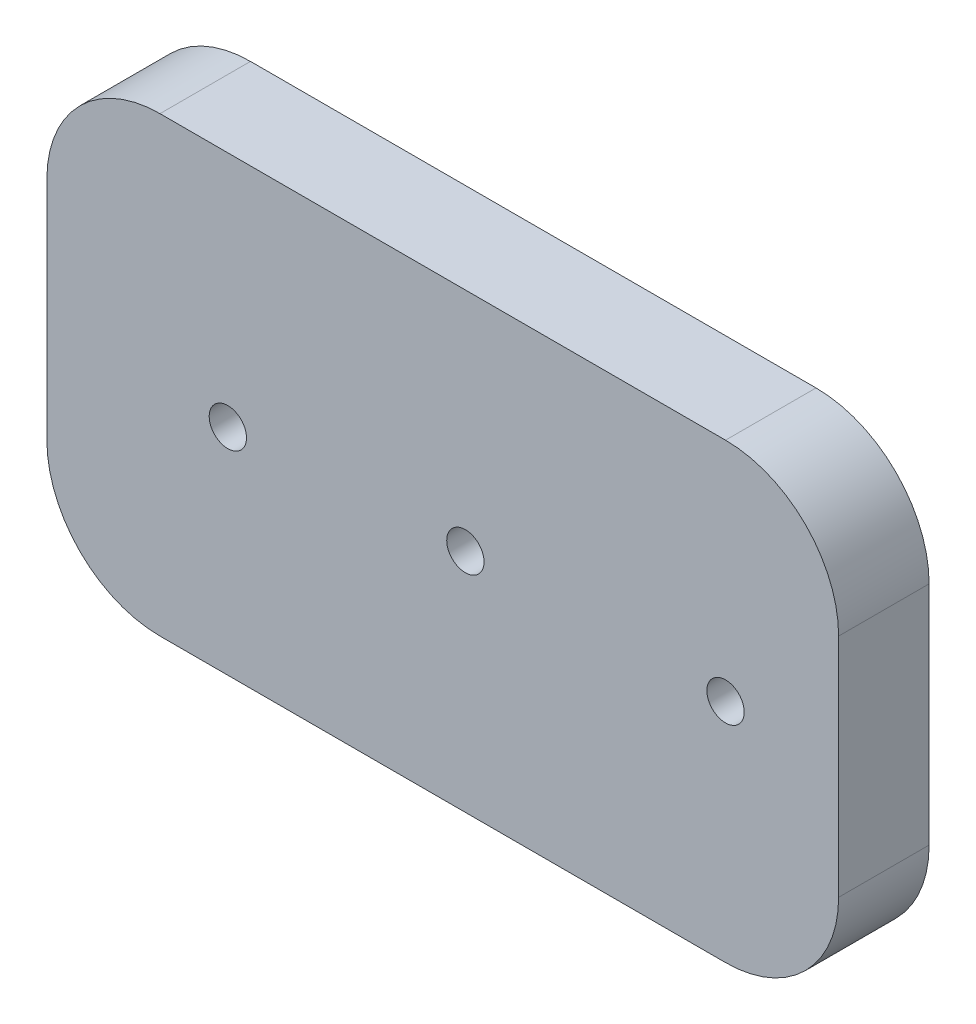
ISO-10303-21;
HEADER;
FILE_DESCRIPTION(('STEP AP214'),'2;1');
FILE_NAME('part.step','',(''),(''),'','','');
FILE_SCHEMA(('AUTOMOTIVE_DESIGN { 1 0 10303 214 1 1 1 1 }'));
ENDSEC;
DATA;
#1=APPLICATION_CONTEXT('core data for automotive mechanical design processes');
#2=APPLICATION_PROTOCOL_DEFINITION('international standard','automotive_design',2000,#1);
#3=PRODUCT_CONTEXT('',#1,'mechanical');
#4=PRODUCT('Part','Part','',(#3));
#5=PRODUCT_RELATED_PRODUCT_CATEGORY('part','',(#4));
#6=PRODUCT_DEFINITION_FORMATION('','',#4);
#7=PRODUCT_DEFINITION_CONTEXT('part definition',#1,'design');
#8=PRODUCT_DEFINITION('design','',#6,#7);
#9=PRODUCT_DEFINITION_SHAPE('','',#8);
#10=(LENGTH_UNIT() NAMED_UNIT(*) SI_UNIT(.MILLI.,.METRE.));
#11=(NAMED_UNIT(*) PLANE_ANGLE_UNIT() SI_UNIT($,.RADIAN.));
#12=(NAMED_UNIT(*) SI_UNIT($,.STERADIAN.) SOLID_ANGLE_UNIT());
#13=UNCERTAINTY_MEASURE_WITH_UNIT(LENGTH_MEASURE(1.E-05),#10,'distance_accuracy_value','');
#14=(GEOMETRIC_REPRESENTATION_CONTEXT(3) GLOBAL_UNCERTAINTY_ASSIGNED_CONTEXT((#13)) GLOBAL_UNIT_ASSIGNED_CONTEXT((#10,
#11,#12)) REPRESENTATION_CONTEXT('',''));
#15=CARTESIAN_POINT('',(0.,0.,0.));
#16=DIRECTION('',(0.,0.,1.));
#17=DIRECTION('',(1.,0.,0.));
#18=AXIS2_PLACEMENT_3D('',#15,#16,#17);
#19=CARTESIAN_POINT('',(35.,-20.,10.));
#20=DIRECTION('',(-1.,0.,0.));
#21=DIRECTION('',(0.,0.,1.));
#22=AXIS2_PLACEMENT_3D('',#19,#20,#21);
#23=PLANE('',#22);
#24=DIRECTION('',(0.,-1.,0.));
#25=VECTOR('',#24,1.);
#26=CARTESIAN_POINT('',(35.,10.,2.));
#27=LINE('',#26,#25);
#28=CARTESIAN_POINT('',(35.,10.,2.));
#29=VERTEX_POINT('',#28);
#30=CARTESIAN_POINT('',(35.,-9.99999999999999,2.));
#31=VERTEX_POINT('',#30);
#32=EDGE_CURVE('E241',#29,#31,#27,.T.);
#33=ORIENTED_EDGE('',*,*,#32,.F.);
#34=DIRECTION('',(0.,0.,-1.));
#35=VECTOR('',#34,1.);
#36=CARTESIAN_POINT('',(35.,10.,10.));
#37=LINE('',#36,#35);
#38=CARTESIAN_POINT('',(35.,10.,10.));
#39=VERTEX_POINT('',#38);
#40=EDGE_CURVE('E233',#29,#39,#37,.F.);
#41=ORIENTED_EDGE('',*,*,#40,.T.);
#42=DIRECTION('',(0.,1.,0.));
#43=VECTOR('',#42,1.);
#44=CARTESIAN_POINT('',(35.,-20.,10.));
#45=LINE('',#44,#43);
#46=CARTESIAN_POINT('',(35.,-9.99999999999999,10.));
#47=VERTEX_POINT('',#46);
#48=EDGE_CURVE('E244',#47,#39,#45,.T.);
#49=ORIENTED_EDGE('',*,*,#48,.F.);
#50=DIRECTION('',(0.,0.,-1.));
#51=VECTOR('',#50,1.);
#52=CARTESIAN_POINT('',(35.,-9.99999999999999,10.));
#53=LINE('',#52,#51);
#54=EDGE_CURVE('E69',#47,#31,#53,.T.);
#55=ORIENTED_EDGE('',*,*,#54,.T.);
#56=EDGE_LOOP('',(#33,#41,#49,#55));
#57=FACE_BOUND('',#56,.T.);
#58=ADVANCED_FACE('F60',(#57),#23,.F.);
#59=CARTESIAN_POINT('',(-35.,20.,10.));
#60=DIRECTION('',(0.,-1.,0.));
#61=DIRECTION('',(0.,0.,-1.));
#62=AXIS2_PLACEMENT_3D('',#59,#60,#61);
#63=PLANE('',#62);
#64=DIRECTION('',(1.,0.,0.));
#65=VECTOR('',#64,1.);
#66=CARTESIAN_POINT('',(-25.,20.,2.));
#67=LINE('',#66,#65);
#68=CARTESIAN_POINT('',(-25.,20.,2.));
#69=VERTEX_POINT('',#68);
#70=CARTESIAN_POINT('',(25.,20.,2.));
#71=VERTEX_POINT('',#70);
#72=EDGE_CURVE('E76',#69,#71,#67,.T.);
#73=ORIENTED_EDGE('',*,*,#72,.F.);
#74=DIRECTION('',(0.,0.,-1.));
#75=VECTOR('',#74,1.);
#76=CARTESIAN_POINT('',(-25.,20.,10.));
#77=LINE('',#76,#75);
#78=CARTESIAN_POINT('',(-25.,20.,10.));
#79=VERTEX_POINT('',#78);
#80=EDGE_CURVE('E213',#69,#79,#77,.F.);
#81=ORIENTED_EDGE('',*,*,#80,.T.);
#82=DIRECTION('',(-1.,0.,0.));
#83=VECTOR('',#82,1.);
#84=CARTESIAN_POINT('',(-35.,20.,10.));
#85=LINE('',#84,#83);
#86=CARTESIAN_POINT('',(25.,20.,10.));
#87=VERTEX_POINT('',#86);
#88=EDGE_CURVE('E389',#87,#79,#85,.T.);
#89=ORIENTED_EDGE('',*,*,#88,.F.);
#90=DIRECTION('',(0.,0.,-1.));
#91=VECTOR('',#90,1.);
#92=CARTESIAN_POINT('',(25.,20.,10.));
#93=LINE('',#92,#91);
#94=EDGE_CURVE('E203',#87,#71,#93,.T.);
#95=ORIENTED_EDGE('',*,*,#94,.T.);
#96=EDGE_LOOP('',(#73,#81,#89,#95));
#97=FACE_BOUND('',#96,.T.);
#98=ADVANCED_FACE('F410',(#97),#63,.F.);
#99=CARTESIAN_POINT('',(-35.,-20.,10.));
#100=DIRECTION('',(1.,0.,0.));
#101=DIRECTION('',(0.,0.,-1.));
#102=AXIS2_PLACEMENT_3D('',#99,#100,#101);
#103=PLANE('',#102);
#104=DIRECTION('',(0.,1.,0.));
#105=VECTOR('',#104,1.);
#106=CARTESIAN_POINT('',(-35.,-9.99999999999999,2.));
#107=LINE('',#106,#105);
#108=CARTESIAN_POINT('',(-35.,-9.99999999999999,2.));
#109=VERTEX_POINT('',#108);
#110=CARTESIAN_POINT('',(-35.,10.,2.));
#111=VERTEX_POINT('',#110);
#112=EDGE_CURVE('E174',#109,#111,#107,.T.);
#113=ORIENTED_EDGE('',*,*,#112,.F.);
#114=DIRECTION('',(0.,0.,-1.));
#115=VECTOR('',#114,1.);
#116=CARTESIAN_POINT('',(-35.,-9.99999999999999,10.));
#117=LINE('',#116,#115);
#118=CARTESIAN_POINT('',(-35.,-9.99999999999999,10.));
#119=VERTEX_POINT('',#118);
#120=EDGE_CURVE('E188',#109,#119,#117,.F.);
#121=ORIENTED_EDGE('',*,*,#120,.T.);
#122=DIRECTION('',(0.,-1.,0.));
#123=VECTOR('',#122,1.);
#124=CARTESIAN_POINT('',(-35.,-20.,10.));
#125=LINE('',#124,#123);
#126=CARTESIAN_POINT('',(-35.,10.,10.));
#127=VERTEX_POINT('',#126);
#128=EDGE_CURVE('E206',#127,#119,#125,.T.);
#129=ORIENTED_EDGE('',*,*,#128,.F.);
#130=DIRECTION('',(0.,0.,-1.));
#131=VECTOR('',#130,1.);
#132=CARTESIAN_POINT('',(-35.,10.,10.));
#133=LINE('',#132,#131);
#134=EDGE_CURVE('E191',#127,#111,#133,.T.);
#135=ORIENTED_EDGE('',*,*,#134,.T.);
#136=EDGE_LOOP('',(#113,#121,#129,#135));
#137=FACE_BOUND('',#136,.T.);
#138=ADVANCED_FACE('F186',(#137),#103,.F.);
#139=CARTESIAN_POINT('',(-35.,-20.,10.));
#140=DIRECTION('',(0.,1.,0.));
#141=DIRECTION('',(0.,0.,1.));
#142=AXIS2_PLACEMENT_3D('',#139,#140,#141);
#143=PLANE('',#142);
#144=DIRECTION('',(-1.,0.,0.));
#145=VECTOR('',#144,1.);
#146=CARTESIAN_POINT('',(25.,-20.,2.));
#147=LINE('',#146,#145);
#148=CARTESIAN_POINT('',(25.,-20.,2.));
#149=VERTEX_POINT('',#148);
#150=CARTESIAN_POINT('',(-25.,-20.,2.));
#151=VERTEX_POINT('',#150);
#152=EDGE_CURVE('E177',#149,#151,#147,.T.);
#153=ORIENTED_EDGE('',*,*,#152,.F.);
#154=DIRECTION('',(0.,0.,-1.));
#155=VECTOR('',#154,1.);
#156=CARTESIAN_POINT('',(25.,-20.,10.));
#157=LINE('',#156,#155);
#158=CARTESIAN_POINT('',(25.,-20.,10.));
#159=VERTEX_POINT('',#158);
#160=EDGE_CURVE('E227',#149,#159,#157,.F.);
#161=ORIENTED_EDGE('',*,*,#160,.T.);
#162=DIRECTION('',(1.,0.,0.));
#163=VECTOR('',#162,1.);
#164=CARTESIAN_POINT('',(-35.,-20.,10.));
#165=LINE('',#164,#163);
#166=CARTESIAN_POINT('',(-25.,-20.,10.));
#167=VERTEX_POINT('',#166);
#168=EDGE_CURVE('E199',#167,#159,#165,.T.);
#169=ORIENTED_EDGE('',*,*,#168,.F.);
#170=DIRECTION('',(0.,0.,-1.));
#171=VECTOR('',#170,1.);
#172=CARTESIAN_POINT('',(-25.,-20.,10.));
#173=LINE('',#172,#171);
#174=EDGE_CURVE('E230',#167,#151,#173,.T.);
#175=ORIENTED_EDGE('',*,*,#174,.T.);
#176=EDGE_LOOP('',(#153,#161,#169,#175));
#177=FACE_BOUND('',#176,.T.);
#178=ADVANCED_FACE('F412',(#177),#143,.F.);
#179=CARTESIAN_POINT('',(-25.,10.,10.));
#180=DIRECTION('',(0.,0.,-1.));
#181=DIRECTION('',(-1.,0.,0.));
#182=AXIS2_PLACEMENT_3D('',#179,#180,#181);
#183=CYLINDRICAL_SURFACE('',#182,10.);
#184=ORIENTED_EDGE('',*,*,#80,.F.);
#185=CARTESIAN_POINT('',(-25.,10.,2.));
#186=DIRECTION('',(0.,0.,-1.));
#187=DIRECTION('',(-1.,0.,0.));
#188=AXIS2_PLACEMENT_3D('',#185,#186,#187);
#189=CIRCLE('',#188,10.);
#190=EDGE_CURVE('E193',#111,#69,#189,.T.);
#191=ORIENTED_EDGE('',*,*,#190,.F.);
#192=ORIENTED_EDGE('',*,*,#134,.F.);
#193=CARTESIAN_POINT('',(-25.,10.,10.));
#194=DIRECTION('',(0.,0.,-1.));
#195=DIRECTION('',(-1.,0.,0.));
#196=AXIS2_PLACEMENT_3D('',#193,#194,#195);
#197=CIRCLE('',#196,10.);
#198=EDGE_CURVE('E224',#79,#127,#197,.F.);
#199=ORIENTED_EDGE('',*,*,#198,.F.);
#200=EDGE_LOOP('',(#184,#191,#192,#199));
#201=FACE_BOUND('',#200,.T.);
#202=ADVANCED_FACE('F399',(#201),#183,.T.);
#203=CARTESIAN_POINT('',(-25.,-9.99999999999999,10.));
#204=DIRECTION('',(0.,0.,-1.));
#205=DIRECTION('',(-1.,0.,0.));
#206=AXIS2_PLACEMENT_3D('',#203,#204,#205);
#207=CYLINDRICAL_SURFACE('',#206,10.);
#208=ORIENTED_EDGE('',*,*,#120,.F.);
#209=CARTESIAN_POINT('',(-25.,-9.99999999999999,2.));
#210=DIRECTION('',(0.,0.,-1.));
#211=DIRECTION('',(-1.,0.,0.));
#212=AXIS2_PLACEMENT_3D('',#209,#210,#211);
#213=CIRCLE('',#212,10.);
#214=EDGE_CURVE('E171',#151,#109,#213,.T.);
#215=ORIENTED_EDGE('',*,*,#214,.F.);
#216=ORIENTED_EDGE('',*,*,#174,.F.);
#217=CARTESIAN_POINT('',(-25.,-9.99999999999999,10.));
#218=DIRECTION('',(0.,0.,-1.));
#219=DIRECTION('',(-1.,0.,0.));
#220=AXIS2_PLACEMENT_3D('',#217,#218,#219);
#221=CIRCLE('',#220,10.);
#222=EDGE_CURVE('E197',#119,#167,#221,.F.);
#223=ORIENTED_EDGE('',*,*,#222,.F.);
#224=EDGE_LOOP('',(#208,#215,#216,#223));
#225=FACE_BOUND('',#224,.T.);
#226=ADVANCED_FACE('F196',(#225),#207,.T.);
#227=CARTESIAN_POINT('',(25.,-9.99999999999999,10.));
#228=DIRECTION('',(0.,0.,-1.));
#229=DIRECTION('',(-1.,0.,0.));
#230=AXIS2_PLACEMENT_3D('',#227,#228,#229);
#231=CYLINDRICAL_SURFACE('',#230,10.);
#232=ORIENTED_EDGE('',*,*,#160,.F.);
#233=CARTESIAN_POINT('',(25.,-9.99999999999999,2.));
#234=DIRECTION('',(0.,0.,-1.));
#235=DIRECTION('',(-1.,0.,0.));
#236=AXIS2_PLACEMENT_3D('',#233,#234,#235);
#237=CIRCLE('',#236,10.);
#238=EDGE_CURVE('E250',#31,#149,#237,.T.);
#239=ORIENTED_EDGE('',*,*,#238,.F.);
#240=ORIENTED_EDGE('',*,*,#54,.F.);
#241=CARTESIAN_POINT('',(25.,-9.99999999999999,10.));
#242=DIRECTION('',(0.,0.,-1.));
#243=DIRECTION('',(-1.,0.,0.));
#244=AXIS2_PLACEMENT_3D('',#241,#242,#243);
#245=CIRCLE('',#244,10.);
#246=EDGE_CURVE('E219',#159,#47,#245,.F.);
#247=ORIENTED_EDGE('',*,*,#246,.F.);
#248=EDGE_LOOP('',(#232,#239,#240,#247));
#249=FACE_BOUND('',#248,.T.);
#250=ADVANCED_FACE('F249',(#249),#231,.T.);
#251=CARTESIAN_POINT('',(25.,10.,10.));
#252=DIRECTION('',(0.,0.,-1.));
#253=DIRECTION('',(-1.,0.,0.));
#254=AXIS2_PLACEMENT_3D('',#251,#252,#253);
#255=CYLINDRICAL_SURFACE('',#254,10.);
#256=ORIENTED_EDGE('',*,*,#40,.F.);
#257=CARTESIAN_POINT('',(25.,10.,2.));
#258=DIRECTION('',(0.,0.,-1.));
#259=DIRECTION('',(-1.,0.,0.));
#260=AXIS2_PLACEMENT_3D('',#257,#258,#259);
#261=CIRCLE('',#260,10.);
#262=EDGE_CURVE('E257',#71,#29,#261,.T.);
#263=ORIENTED_EDGE('',*,*,#262,.F.);
#264=ORIENTED_EDGE('',*,*,#94,.F.);
#265=CARTESIAN_POINT('',(25.,10.,10.));
#266=DIRECTION('',(0.,0.,-1.));
#267=DIRECTION('',(-1.,0.,0.));
#268=AXIS2_PLACEMENT_3D('',#265,#266,#267);
#269=CIRCLE('',#268,10.);
#270=EDGE_CURVE('E216',#39,#87,#269,.F.);
#271=ORIENTED_EDGE('',*,*,#270,.F.);
#272=EDGE_LOOP('',(#256,#263,#264,#271));
#273=FACE_BOUND('',#272,.T.);
#274=ADVANCED_FACE('F62',(#273),#255,.T.);
#275=CARTESIAN_POINT('',(34.,-20.,10.));
#276=DIRECTION('',(-1.,0.,0.));
#277=DIRECTION('',(0.,0.,1.));
#278=AXIS2_PLACEMENT_3D('',#275,#276,#277);
#279=PLANE('',#278);
#280=DIRECTION('',(0.,0.,1.));
#281=VECTOR('',#280,1.);
#282=CARTESIAN_POINT('',(34.,10.,10.));
#283=LINE('',#282,#281);
#284=CARTESIAN_POINT('',(34.,10.,2.));
#285=VERTEX_POINT('',#284);
#286=CARTESIAN_POINT('',(34.,10.,9.));
#287=VERTEX_POINT('',#286);
#288=EDGE_CURVE('E311',#285,#287,#283,.T.);
#289=ORIENTED_EDGE('',*,*,#288,.F.);
#290=DIRECTION('',(0.,-1.,0.));
#291=VECTOR('',#290,1.);
#292=CARTESIAN_POINT('',(34.,-20.,2.));
#293=LINE('',#292,#291);
#294=CARTESIAN_POINT('',(34.,-9.99999999999999,2.));
#295=VERTEX_POINT('',#294);
#296=EDGE_CURVE('E83',#285,#295,#293,.T.);
#297=ORIENTED_EDGE('',*,*,#296,.T.);
#298=DIRECTION('',(0.,0.,1.));
#299=VECTOR('',#298,1.);
#300=CARTESIAN_POINT('',(34.,-9.99999999999999,10.));
#301=LINE('',#300,#299);
#302=CARTESIAN_POINT('',(34.,-9.99999999999999,9.));
#303=VERTEX_POINT('',#302);
#304=EDGE_CURVE('E306',#303,#295,#301,.F.);
#305=ORIENTED_EDGE('',*,*,#304,.F.);
#306=DIRECTION('',(0.,1.,0.));
#307=VECTOR('',#306,1.);
#308=CARTESIAN_POINT('',(34.,0.,9.));
#309=LINE('',#308,#307);
#310=EDGE_CURVE('E300',#303,#287,#309,.T.);
#311=ORIENTED_EDGE('',*,*,#310,.T.);
#312=EDGE_LOOP('',(#289,#297,#305,#311));
#313=FACE_BOUND('',#312,.T.);
#314=ADVANCED_FACE('F435',(#313),#279,.T.);
#315=CARTESIAN_POINT('',(-35.,19.,10.));
#316=DIRECTION('',(0.,-1.,0.));
#317=DIRECTION('',(0.,0.,-1.));
#318=AXIS2_PLACEMENT_3D('',#315,#316,#317);
#319=PLANE('',#318);
#320=DIRECTION('',(0.,0.,-1.));
#321=VECTOR('',#320,1.);
#322=CARTESIAN_POINT('',(-25.,19.,10.));
#323=LINE('',#322,#321);
#324=CARTESIAN_POINT('',(-25.,19.,2.));
#325=VERTEX_POINT('',#324);
#326=CARTESIAN_POINT('',(-25.,19.,9.));
#327=VERTEX_POINT('',#326);
#328=EDGE_CURVE('E351',#325,#327,#323,.F.);
#329=ORIENTED_EDGE('',*,*,#328,.F.);
#330=DIRECTION('',(1.,0.,0.));
#331=VECTOR('',#330,1.);
#332=CARTESIAN_POINT('',(-35.,19.,2.));
#333=LINE('',#332,#331);
#334=CARTESIAN_POINT('',(25.,19.,2.));
#335=VERTEX_POINT('',#334);
#336=EDGE_CURVE('E255',#325,#335,#333,.T.);
#337=ORIENTED_EDGE('',*,*,#336,.T.);
#338=DIRECTION('',(0.,0.,-1.));
#339=VECTOR('',#338,1.);
#340=CARTESIAN_POINT('',(25.,19.,10.));
#341=LINE('',#340,#339);
#342=CARTESIAN_POINT('',(25.,19.,9.));
#343=VERTEX_POINT('',#342);
#344=EDGE_CURVE('E354',#343,#335,#341,.T.);
#345=ORIENTED_EDGE('',*,*,#344,.F.);
#346=DIRECTION('',(-1.,0.,0.));
#347=VECTOR('',#346,1.);
#348=CARTESIAN_POINT('',(0.,19.,9.));
#349=LINE('',#348,#347);
#350=EDGE_CURVE('E304',#343,#327,#349,.T.);
#351=ORIENTED_EDGE('',*,*,#350,.T.);
#352=EDGE_LOOP('',(#329,#337,#345,#351));
#353=FACE_BOUND('',#352,.T.);
#354=ADVANCED_FACE('F439',(#353),#319,.T.);
#355=CARTESIAN_POINT('',(-34.,-20.,10.));
#356=DIRECTION('',(1.,0.,0.));
#357=DIRECTION('',(0.,0.,-1.));
#358=AXIS2_PLACEMENT_3D('',#355,#356,#357);
#359=PLANE('',#358);
#360=DIRECTION('',(0.,0.,-1.));
#361=VECTOR('',#360,1.);
#362=CARTESIAN_POINT('',(-34.,-9.99999999999999,10.));
#363=LINE('',#362,#361);
#364=CARTESIAN_POINT('',(-34.,-9.99999999999999,2.));
#365=VERTEX_POINT('',#364);
#366=CARTESIAN_POINT('',(-34.,-9.99999999999999,9.));
#367=VERTEX_POINT('',#366);
#368=EDGE_CURVE('E345',#365,#367,#363,.F.);
#369=ORIENTED_EDGE('',*,*,#368,.F.);
#370=DIRECTION('',(0.,1.,0.));
#371=VECTOR('',#370,1.);
#372=CARTESIAN_POINT('',(-34.,-20.,2.));
#373=LINE('',#372,#371);
#374=CARTESIAN_POINT('',(-34.,10.,2.));
#375=VERTEX_POINT('',#374);
#376=EDGE_CURVE('E276',#365,#375,#373,.T.);
#377=ORIENTED_EDGE('',*,*,#376,.T.);
#378=DIRECTION('',(0.,0.,-1.));
#379=VECTOR('',#378,1.);
#380=CARTESIAN_POINT('',(-34.,10.,10.));
#381=LINE('',#380,#379);
#382=CARTESIAN_POINT('',(-34.,10.,9.));
#383=VERTEX_POINT('',#382);
#384=EDGE_CURVE('E358',#383,#375,#381,.T.);
#385=ORIENTED_EDGE('',*,*,#384,.F.);
#386=DIRECTION('',(0.,-1.,0.));
#387=VECTOR('',#386,1.);
#388=CARTESIAN_POINT('',(-34.,0.,9.));
#389=LINE('',#388,#387);
#390=EDGE_CURVE('E329',#383,#367,#389,.T.);
#391=ORIENTED_EDGE('',*,*,#390,.T.);
#392=EDGE_LOOP('',(#369,#377,#385,#391));
#393=FACE_BOUND('',#392,.T.);
#394=ADVANCED_FACE('F445',(#393),#359,.T.);
#395=CARTESIAN_POINT('',(-35.,-19.,10.));
#396=DIRECTION('',(0.,1.,0.));
#397=DIRECTION('',(0.,0.,1.));
#398=AXIS2_PLACEMENT_3D('',#395,#396,#397);
#399=PLANE('',#398);
#400=DIRECTION('',(0.,0.,1.));
#401=VECTOR('',#400,1.);
#402=CARTESIAN_POINT('',(25.,-19.,10.));
#403=LINE('',#402,#401);
#404=CARTESIAN_POINT('',(25.,-19.,2.));
#405=VERTEX_POINT('',#404);
#406=CARTESIAN_POINT('',(25.,-19.,9.));
#407=VERTEX_POINT('',#406);
#408=EDGE_CURVE('E333',#405,#407,#403,.T.);
#409=ORIENTED_EDGE('',*,*,#408,.F.);
#410=DIRECTION('',(-1.,0.,0.));
#411=VECTOR('',#410,1.);
#412=CARTESIAN_POINT('',(-35.,-19.,2.));
#413=LINE('',#412,#411);
#414=CARTESIAN_POINT('',(-25.,-19.,2.));
#415=VERTEX_POINT('',#414);
#416=EDGE_CURVE('E272',#405,#415,#413,.T.);
#417=ORIENTED_EDGE('',*,*,#416,.T.);
#418=DIRECTION('',(0.,0.,1.));
#419=VECTOR('',#418,1.);
#420=CARTESIAN_POINT('',(-25.,-19.,10.));
#421=LINE('',#420,#419);
#422=CARTESIAN_POINT('',(-25.,-19.,9.));
#423=VERTEX_POINT('',#422);
#424=EDGE_CURVE('E314',#423,#415,#421,.F.);
#425=ORIENTED_EDGE('',*,*,#424,.F.);
#426=DIRECTION('',(1.,0.,0.));
#427=VECTOR('',#426,1.);
#428=CARTESIAN_POINT('',(0.,-19.,9.));
#429=LINE('',#428,#427);
#430=EDGE_CURVE('E338',#423,#407,#429,.T.);
#431=ORIENTED_EDGE('',*,*,#430,.T.);
#432=EDGE_LOOP('',(#409,#417,#425,#431));
#433=FACE_BOUND('',#432,.T.);
#434=ADVANCED_FACE('F455',(#433),#399,.T.);
#435=CARTESIAN_POINT('',(-25.,10.,10.));
#436=DIRECTION('',(0.,0.,-1.));
#437=DIRECTION('',(-1.,0.,0.));
#438=AXIS2_PLACEMENT_3D('',#435,#436,#437);
#439=CYLINDRICAL_SURFACE('',#438,9.);
#440=CARTESIAN_POINT('',(-25.,10.,2.));
#441=DIRECTION('',(0.,0.,-1.));
#442=DIRECTION('',(-1.,0.,0.));
#443=AXIS2_PLACEMENT_3D('',#440,#441,#442);
#444=CIRCLE('',#443,9.);
#445=EDGE_CURVE('E269',#325,#375,#444,.F.);
#446=ORIENTED_EDGE('',*,*,#445,.F.);
#447=ORIENTED_EDGE('',*,*,#328,.T.);
#448=CARTESIAN_POINT('',(-25.,10.,9.));
#449=DIRECTION('',(0.,0.,-1.));
#450=DIRECTION('',(-1.,0.,0.));
#451=AXIS2_PLACEMENT_3D('',#448,#449,#450);
#452=CIRCLE('',#451,9.);
#453=EDGE_CURVE('E330',#327,#383,#452,.F.);
#454=ORIENTED_EDGE('',*,*,#453,.T.);
#455=ORIENTED_EDGE('',*,*,#384,.T.);
#456=EDGE_LOOP('',(#446,#447,#454,#455));
#457=FACE_BOUND('',#456,.T.);
#458=ADVANCED_FACE('F459',(#457),#439,.F.);
#459=CARTESIAN_POINT('',(-25.,-9.99999999999999,10.));
#460=DIRECTION('',(0.,0.,-1.));
#461=DIRECTION('',(-1.,0.,0.));
#462=AXIS2_PLACEMENT_3D('',#459,#460,#461);
#463=CYLINDRICAL_SURFACE('',#462,9.);
#464=CARTESIAN_POINT('',(-25.,-9.99999999999999,2.));
#465=DIRECTION('',(0.,0.,-1.));
#466=DIRECTION('',(-1.,0.,0.));
#467=AXIS2_PLACEMENT_3D('',#464,#465,#466);
#468=CIRCLE('',#467,9.);
#469=EDGE_CURVE('E280',#365,#415,#468,.F.);
#470=ORIENTED_EDGE('',*,*,#469,.F.);
#471=ORIENTED_EDGE('',*,*,#368,.T.);
#472=CARTESIAN_POINT('',(-25.,-9.99999999999999,9.));
#473=DIRECTION('',(0.,0.,-1.));
#474=DIRECTION('',(-1.,0.,0.));
#475=AXIS2_PLACEMENT_3D('',#472,#473,#474);
#476=CIRCLE('',#475,9.);
#477=EDGE_CURVE('E334',#367,#423,#476,.F.);
#478=ORIENTED_EDGE('',*,*,#477,.T.);
#479=ORIENTED_EDGE('',*,*,#424,.T.);
#480=EDGE_LOOP('',(#470,#471,#478,#479));
#481=FACE_BOUND('',#480,.T.);
#482=ADVANCED_FACE('F480',(#481),#463,.F.);
#483=CARTESIAN_POINT('',(25.,-9.99999999999999,10.));
#484=DIRECTION('',(0.,0.,-1.));
#485=DIRECTION('',(-1.,0.,0.));
#486=AXIS2_PLACEMENT_3D('',#483,#484,#485);
#487=CYLINDRICAL_SURFACE('',#486,9.);
#488=CARTESIAN_POINT('',(25.,-9.99999999999999,2.));
#489=DIRECTION('',(0.,0.,-1.));
#490=DIRECTION('',(-1.,0.,0.));
#491=AXIS2_PLACEMENT_3D('',#488,#489,#490);
#492=CIRCLE('',#491,9.);
#493=EDGE_CURVE('E266',#405,#295,#492,.F.);
#494=ORIENTED_EDGE('',*,*,#493,.F.);
#495=ORIENTED_EDGE('',*,*,#408,.T.);
#496=CARTESIAN_POINT('',(25.,-9.99999999999999,9.));
#497=DIRECTION('',(0.,0.,-1.));
#498=DIRECTION('',(-1.,0.,0.));
#499=AXIS2_PLACEMENT_3D('',#496,#497,#498);
#500=CIRCLE('',#499,9.);
#501=EDGE_CURVE('E341',#407,#303,#500,.F.);
#502=ORIENTED_EDGE('',*,*,#501,.T.);
#503=ORIENTED_EDGE('',*,*,#304,.T.);
#504=EDGE_LOOP('',(#494,#495,#502,#503));
#505=FACE_BOUND('',#504,.T.);
#506=ADVANCED_FACE('F484',(#505),#487,.F.);
#507=CARTESIAN_POINT('',(25.,10.,10.));
#508=DIRECTION('',(0.,0.,-1.));
#509=DIRECTION('',(-1.,0.,0.));
#510=AXIS2_PLACEMENT_3D('',#507,#508,#509);
#511=CYLINDRICAL_SURFACE('',#510,9.);
#512=CARTESIAN_POINT('',(25.,10.,2.));
#513=DIRECTION('',(0.,0.,-1.));
#514=DIRECTION('',(-1.,0.,0.));
#515=AXIS2_PLACEMENT_3D('',#512,#513,#514);
#516=CIRCLE('',#515,9.);
#517=EDGE_CURVE('E12',#285,#335,#516,.F.);
#518=ORIENTED_EDGE('',*,*,#517,.F.);
#519=ORIENTED_EDGE('',*,*,#288,.T.);
#520=CARTESIAN_POINT('',(25.,10.,9.));
#521=DIRECTION('',(0.,0.,-1.));
#522=DIRECTION('',(-1.,0.,0.));
#523=AXIS2_PLACEMENT_3D('',#520,#521,#522);
#524=CIRCLE('',#523,9.);
#525=EDGE_CURVE('E348',#287,#343,#524,.F.);
#526=ORIENTED_EDGE('',*,*,#525,.T.);
#527=ORIENTED_EDGE('',*,*,#344,.T.);
#528=EDGE_LOOP('',(#518,#519,#526,#527));
#529=FACE_BOUND('',#528,.T.);
#530=ADVANCED_FACE('F488',(#529),#511,.F.);
#531=CARTESIAN_POINT('',(0.,0.,0.));
#532=DIRECTION('',(0.,0.,-1.));
#533=DIRECTION('',(-1.,0.,0.));
#534=AXIS2_PLACEMENT_3D('',#531,#532,#533);
#535=PLANE('',#534);
#536=CARTESIAN_POINT('',(-19.,-1.,0.));
#537=DIRECTION('',(0.,0.,-1.));
#538=DIRECTION('',(-1.,0.,0.));
#539=AXIS2_PLACEMENT_3D('',#536,#537,#538);
#540=CIRCLE('',#539,1.65);
#541=CARTESIAN_POINT('',(-20.65,-1.,0.));
#542=VERTEX_POINT('',#541);
#543=EDGE_CURVE('E380',#542,#542,#540,.T.);
#544=ORIENTED_EDGE('',*,*,#543,.F.);
#545=EDGE_LOOP('',(#544));
#546=FACE_BOUND('',#545,.T.);
#547=CARTESIAN_POINT('',(-19.,-1.,0.));
#548=DIRECTION('',(0.,0.,-1.));
#549=DIRECTION('',(-1.,0.,0.));
#550=AXIS2_PLACEMENT_3D('',#547,#548,#549);
#551=CIRCLE('',#550,2.65);
#552=CARTESIAN_POINT('',(-21.65,-1.,0.));
#553=VERTEX_POINT('',#552);
#554=EDGE_CURVE('E322',#553,#553,#551,.T.);
#555=ORIENTED_EDGE('',*,*,#554,.T.);
#556=EDGE_LOOP('',(#555));
#557=FACE_BOUND('',#556,.T.);
#558=ADVANCED_FACE('F492',(#546,#557),#535,.T.);
#559=CARTESIAN_POINT('',(0.,0.,10.));
#560=DIRECTION('',(0.,0.,-1.));
#561=DIRECTION('',(-1.,0.,0.));
#562=AXIS2_PLACEMENT_3D('',#559,#560,#561);
#563=PLANE('',#562);
#564=CARTESIAN_POINT('',(25.,0.,10.));
#565=DIRECTION('',(0.,0.,-1.));
#566=DIRECTION('',(-1.,0.,0.));
#567=AXIS2_PLACEMENT_3D('',#564,#565,#566);
#568=CIRCLE('',#567,1.64999999999998);
#569=CARTESIAN_POINT('',(23.35,0.,10.));
#570=VERTEX_POINT('',#569);
#571=EDGE_CURVE('E372',#570,#570,#568,.T.);
#572=ORIENTED_EDGE('',*,*,#571,.T.);
#573=EDGE_LOOP('',(#572));
#574=FACE_BOUND('',#573,.T.);
#575=CARTESIAN_POINT('',(2.,0.,10.));
#576=DIRECTION('',(0.,0.,-1.));
#577=DIRECTION('',(-1.,0.,0.));
#578=AXIS2_PLACEMENT_3D('',#575,#576,#577);
#579=CIRCLE('',#578,1.65);
#580=CARTESIAN_POINT('',(0.35,0.,10.));
#581=VERTEX_POINT('',#580);
#582=EDGE_CURVE('E376',#581,#581,#579,.T.);
#583=ORIENTED_EDGE('',*,*,#582,.T.);
#584=EDGE_LOOP('',(#583));
#585=FACE_BOUND('',#584,.T.);
#586=CARTESIAN_POINT('',(-19.,-1.,10.));
#587=DIRECTION('',(0.,0.,-1.));
#588=DIRECTION('',(-1.,0.,0.));
#589=AXIS2_PLACEMENT_3D('',#586,#587,#588);
#590=CIRCLE('',#589,1.65);
#591=CARTESIAN_POINT('',(-20.65,-1.,10.));
#592=VERTEX_POINT('',#591);
#593=EDGE_CURVE('E310',#592,#592,#590,.T.);
#594=ORIENTED_EDGE('',*,*,#593,.T.);
#595=EDGE_LOOP('',(#594));
#596=FACE_BOUND('',#595,.T.);
#597=ORIENTED_EDGE('',*,*,#88,.T.);
#598=ORIENTED_EDGE('',*,*,#198,.T.);
#599=ORIENTED_EDGE('',*,*,#128,.T.);
#600=ORIENTED_EDGE('',*,*,#222,.T.);
#601=ORIENTED_EDGE('',*,*,#168,.T.);
#602=ORIENTED_EDGE('',*,*,#246,.T.);
#603=ORIENTED_EDGE('',*,*,#48,.T.);
#604=ORIENTED_EDGE('',*,*,#270,.T.);
#605=EDGE_LOOP('',(#597,#598,#599,#600,#601,#602,#603,#604));
#606=FACE_BOUND('',#605,.T.);
#607=ADVANCED_FACE('F394',(#574,#585,#596,#606),#563,.F.);
#608=CARTESIAN_POINT('',(-19.,-1.,10.));
#609=DIRECTION('',(0.,0.,-1.));
#610=DIRECTION('',(-1.,0.,0.));
#611=AXIS2_PLACEMENT_3D('',#608,#609,#610);
#612=CYLINDRICAL_SURFACE('',#611,1.65);
#613=ORIENTED_EDGE('',*,*,#593,.F.);
#614=EDGE_LOOP('',(#613));
#615=FACE_BOUND('',#614,.T.);
#616=ORIENTED_EDGE('',*,*,#543,.T.);
#617=EDGE_LOOP('',(#616));
#618=FACE_BOUND('',#617,.T.);
#619=ADVANCED_FACE('F500',(#615,#618),#612,.F.);
#620=CARTESIAN_POINT('',(2.,0.,10.));
#621=DIRECTION('',(0.,0.,-1.));
#622=DIRECTION('',(-1.,0.,0.));
#623=AXIS2_PLACEMENT_3D('',#620,#621,#622);
#624=CYLINDRICAL_SURFACE('',#623,1.65);
#625=ORIENTED_EDGE('',*,*,#582,.F.);
#626=EDGE_LOOP('',(#625));
#627=FACE_BOUND('',#626,.T.);
#628=CARTESIAN_POINT('',(2.,0.,-4.));
#629=DIRECTION('',(0.,0.,-1.));
#630=DIRECTION('',(-1.,0.,0.));
#631=AXIS2_PLACEMENT_3D('',#628,#629,#630);
#632=CIRCLE('',#631,1.65);
#633=CARTESIAN_POINT('',(0.35,0.,-4.));
#634=VERTEX_POINT('',#633);
#635=EDGE_CURVE('E291',#634,#634,#632,.T.);
#636=ORIENTED_EDGE('',*,*,#635,.T.);
#637=EDGE_LOOP('',(#636));
#638=FACE_BOUND('',#637,.T.);
#639=ADVANCED_FACE('F496',(#627,#638),#624,.F.);
#640=CARTESIAN_POINT('',(25.,0.,10.));
#641=DIRECTION('',(0.,0.,-1.));
#642=DIRECTION('',(-1.,0.,0.));
#643=AXIS2_PLACEMENT_3D('',#640,#641,#642);
#644=CYLINDRICAL_SURFACE('',#643,1.64999999999998);
#645=ORIENTED_EDGE('',*,*,#571,.F.);
#646=EDGE_LOOP('',(#645));
#647=FACE_BOUND('',#646,.T.);
#648=CARTESIAN_POINT('',(25.,0.,-4.));
#649=DIRECTION('',(0.,0.,-1.));
#650=DIRECTION('',(-1.,0.,0.));
#651=AXIS2_PLACEMENT_3D('',#648,#649,#650);
#652=CIRCLE('',#651,1.64999999999998);
#653=CARTESIAN_POINT('',(23.35,0.,-4.));
#654=VERTEX_POINT('',#653);
#655=EDGE_CURVE('E287',#654,#654,#652,.T.);
#656=ORIENTED_EDGE('',*,*,#655,.T.);
#657=EDGE_LOOP('',(#656));
#658=FACE_BOUND('',#657,.T.);
#659=ADVANCED_FACE('F465',(#647,#658),#644,.F.);
#660=CARTESIAN_POINT('',(0.,0.,9.));
#661=DIRECTION('',(0.,0.,-1.));
#662=DIRECTION('',(-1.,0.,0.));
#663=AXIS2_PLACEMENT_3D('',#660,#661,#662);
#664=PLANE('',#663);
#665=CARTESIAN_POINT('',(25.,0.,9.));
#666=DIRECTION('',(0.,0.,-1.));
#667=DIRECTION('',(-1.,0.,0.));
#668=AXIS2_PLACEMENT_3D('',#665,#666,#667);
#669=CIRCLE('',#668,2.64999999999998);
#670=CARTESIAN_POINT('',(22.35,0.,9.));
#671=VERTEX_POINT('',#670);
#672=EDGE_CURVE('E305',#671,#671,#669,.T.);
#673=ORIENTED_EDGE('',*,*,#672,.F.);
#674=EDGE_LOOP('',(#673));
#675=FACE_BOUND('',#674,.T.);
#676=CARTESIAN_POINT('',(2.,0.,9.));
#677=DIRECTION('',(0.,0.,-1.));
#678=DIRECTION('',(-1.,0.,0.));
#679=AXIS2_PLACEMENT_3D('',#676,#677,#678);
#680=CIRCLE('',#679,2.65);
#681=CARTESIAN_POINT('',(-0.65,0.,9.));
#682=VERTEX_POINT('',#681);
#683=EDGE_CURVE('E318',#682,#682,#680,.T.);
#684=ORIENTED_EDGE('',*,*,#683,.F.);
#685=EDGE_LOOP('',(#684));
#686=FACE_BOUND('',#685,.T.);
#687=CARTESIAN_POINT('',(-19.,-1.,9.));
#688=DIRECTION('',(0.,0.,-1.));
#689=DIRECTION('',(-1.,0.,0.));
#690=AXIS2_PLACEMENT_3D('',#687,#688,#689);
#691=CIRCLE('',#690,2.65);
#692=CARTESIAN_POINT('',(-21.65,-1.,9.));
#693=VERTEX_POINT('',#692);
#694=EDGE_CURVE('E299',#693,#693,#691,.T.);
#695=ORIENTED_EDGE('',*,*,#694,.F.);
#696=EDGE_LOOP('',(#695));
#697=FACE_BOUND('',#696,.T.);
#698=ORIENTED_EDGE('',*,*,#350,.F.);
#699=ORIENTED_EDGE('',*,*,#525,.F.);
#700=ORIENTED_EDGE('',*,*,#310,.F.);
#701=ORIENTED_EDGE('',*,*,#501,.F.);
#702=ORIENTED_EDGE('',*,*,#430,.F.);
#703=ORIENTED_EDGE('',*,*,#477,.F.);
#704=ORIENTED_EDGE('',*,*,#390,.F.);
#705=ORIENTED_EDGE('',*,*,#453,.F.);
#706=EDGE_LOOP('',(#698,#699,#700,#701,#702,#703,#704,#705));
#707=FACE_BOUND('',#706,.T.);
#708=ADVANCED_FACE('F461',(#675,#686,#697,#707),#664,.T.);
#709=CARTESIAN_POINT('',(-19.,-1.,10.));
#710=DIRECTION('',(0.,0.,-1.));
#711=DIRECTION('',(-1.,0.,0.));
#712=AXIS2_PLACEMENT_3D('',#709,#710,#711);
#713=CYLINDRICAL_SURFACE('',#712,2.65);
#714=ORIENTED_EDGE('',*,*,#694,.T.);
#715=EDGE_LOOP('',(#714));
#716=FACE_BOUND('',#715,.T.);
#717=ORIENTED_EDGE('',*,*,#554,.F.);
#718=EDGE_LOOP('',(#717));
#719=FACE_BOUND('',#718,.T.);
#720=ADVANCED_FACE('F464',(#716,#719),#713,.T.);
#721=CARTESIAN_POINT('',(2.,0.,10.));
#722=DIRECTION('',(0.,0.,-1.));
#723=DIRECTION('',(-1.,0.,0.));
#724=AXIS2_PLACEMENT_3D('',#721,#722,#723);
#725=CYLINDRICAL_SURFACE('',#724,2.65);
#726=ORIENTED_EDGE('',*,*,#683,.T.);
#727=EDGE_LOOP('',(#726));
#728=FACE_BOUND('',#727,.T.);
#729=CARTESIAN_POINT('',(2.,0.,-4.));
#730=DIRECTION('',(0.,0.,-1.));
#731=DIRECTION('',(-1.,0.,0.));
#732=AXIS2_PLACEMENT_3D('',#729,#730,#731);
#733=CIRCLE('',#732,2.65);
#734=CARTESIAN_POINT('',(-0.65,0.,-4.));
#735=VERTEX_POINT('',#734);
#736=EDGE_CURVE('E295',#735,#735,#733,.T.);
#737=ORIENTED_EDGE('',*,*,#736,.F.);
#738=EDGE_LOOP('',(#737));
#739=FACE_BOUND('',#738,.T.);
#740=ADVANCED_FACE('F469',(#728,#739),#725,.T.);
#741=CARTESIAN_POINT('',(25.,0.,10.));
#742=DIRECTION('',(0.,0.,-1.));
#743=DIRECTION('',(-1.,0.,0.));
#744=AXIS2_PLACEMENT_3D('',#741,#742,#743);
#745=CYLINDRICAL_SURFACE('',#744,2.64999999999998);
#746=ORIENTED_EDGE('',*,*,#672,.T.);
#747=EDGE_LOOP('',(#746));
#748=FACE_BOUND('',#747,.T.);
#749=CARTESIAN_POINT('',(25.,0.,-4.));
#750=DIRECTION('',(0.,0.,-1.));
#751=DIRECTION('',(-1.,0.,0.));
#752=AXIS2_PLACEMENT_3D('',#749,#750,#751);
#753=CIRCLE('',#752,2.64999999999999);
#754=CARTESIAN_POINT('',(22.35,0.,-4.));
#755=VERTEX_POINT('',#754);
#756=EDGE_CURVE('E283',#755,#755,#753,.T.);
#757=ORIENTED_EDGE('',*,*,#756,.F.);
#758=EDGE_LOOP('',(#757));
#759=FACE_BOUND('',#758,.T.);
#760=ADVANCED_FACE('F473',(#748,#759),#745,.T.);
#761=CARTESIAN_POINT('',(2.,0.,-4.));
#762=DIRECTION('',(0.,0.,-1.));
#763=DIRECTION('',(-1.,0.,0.));
#764=AXIS2_PLACEMENT_3D('',#761,#762,#763);
#765=PLANE('',#764);
#766=ORIENTED_EDGE('',*,*,#736,.T.);
#767=EDGE_LOOP('',(#766));
#768=FACE_BOUND('',#767,.T.);
#769=ORIENTED_EDGE('',*,*,#635,.F.);
#770=EDGE_LOOP('',(#769));
#771=FACE_BOUND('',#770,.T.);
#772=ADVANCED_FACE('F450',(#768,#771),#765,.T.);
#773=CARTESIAN_POINT('',(25.,0.,-4.));
#774=DIRECTION('',(0.,0.,-1.));
#775=DIRECTION('',(-1.,0.,0.));
#776=AXIS2_PLACEMENT_3D('',#773,#774,#775);
#777=PLANE('',#776);
#778=ORIENTED_EDGE('',*,*,#756,.T.);
#779=EDGE_LOOP('',(#778));
#780=FACE_BOUND('',#779,.T.);
#781=ORIENTED_EDGE('',*,*,#655,.F.);
#782=EDGE_LOOP('',(#781));
#783=FACE_BOUND('',#782,.T.);
#784=ADVANCED_FACE('F554',(#780,#783),#777,.T.);
#785=CARTESIAN_POINT('',(-25.,-9.99999999999999,2.));
#786=DIRECTION('',(0.,0.,-1.));
#787=DIRECTION('',(-1.,0.,0.));
#788=AXIS2_PLACEMENT_3D('',#785,#786,#787);
#789=PLANE('',#788);
#790=ORIENTED_EDGE('',*,*,#214,.T.);
#791=ORIENTED_EDGE('',*,*,#112,.T.);
#792=ORIENTED_EDGE('',*,*,#190,.T.);
#793=ORIENTED_EDGE('',*,*,#72,.T.);
#794=ORIENTED_EDGE('',*,*,#262,.T.);
#795=ORIENTED_EDGE('',*,*,#32,.T.);
#796=ORIENTED_EDGE('',*,*,#238,.T.);
#797=ORIENTED_EDGE('',*,*,#152,.T.);
#798=EDGE_LOOP('',(#790,#791,#792,#793,#794,#795,#796,#797));
#799=FACE_BOUND('',#798,.T.);
#800=ORIENTED_EDGE('',*,*,#469,.T.);
#801=ORIENTED_EDGE('',*,*,#416,.F.);
#802=ORIENTED_EDGE('',*,*,#493,.T.);
#803=ORIENTED_EDGE('',*,*,#296,.F.);
#804=ORIENTED_EDGE('',*,*,#517,.T.);
#805=ORIENTED_EDGE('',*,*,#336,.F.);
#806=ORIENTED_EDGE('',*,*,#445,.T.);
#807=ORIENTED_EDGE('',*,*,#376,.F.);
#808=EDGE_LOOP('',(#800,#801,#802,#803,#804,#805,#806,#807));
#809=FACE_BOUND('',#808,.T.);
#810=ADVANCED_FACE('F173',(#799,#809),#789,.T.);
#811=CLOSED_SHELL('',(#58,#98,#138,#178,#202,#226,#250,#274,#314,#354,#394,#434,#458,#482,#506,
#530,#558,#607,#619,#639,#659,#708,#720,#740,#760,#772,#784,#810));
#812=MANIFOLD_SOLID_BREP('B2',#811);
#813=ADVANCED_BREP_SHAPE_REPRESENTATION('',(#18,#812),#14);
#814=SHAPE_DEFINITION_REPRESENTATION(#9,#813);
ENDSEC;
END-ISO-10303-21;
